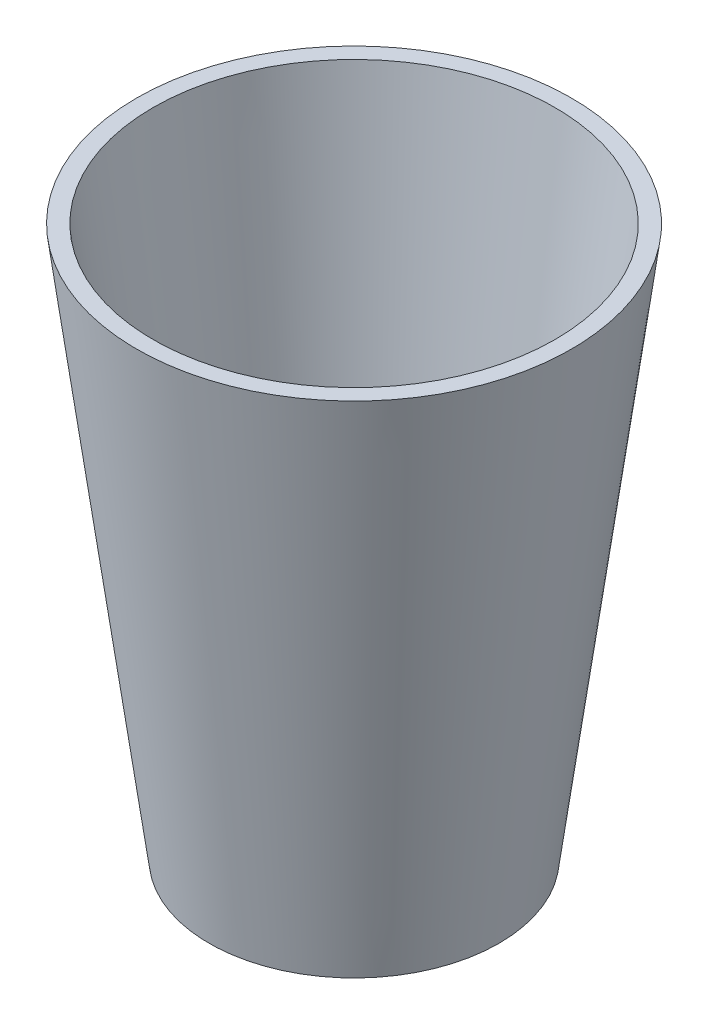
ISO-10303-21;
HEADER;
FILE_DESCRIPTION(('STEP AP214'),'2;1');
FILE_NAME('part.step','',(''),(''),'','','');
FILE_SCHEMA(('AUTOMOTIVE_DESIGN { 1 0 10303 214 1 1 1 1 }'));
ENDSEC;
DATA;
#1=APPLICATION_CONTEXT('core data for automotive mechanical design processes');
#2=APPLICATION_PROTOCOL_DEFINITION('international standard','automotive_design',2000,#1);
#3=PRODUCT_CONTEXT('',#1,'mechanical');
#4=PRODUCT('Part','Part','',(#3));
#5=PRODUCT_RELATED_PRODUCT_CATEGORY('part','',(#4));
#6=PRODUCT_DEFINITION_FORMATION('','',#4);
#7=PRODUCT_DEFINITION_CONTEXT('part definition',#1,'design');
#8=PRODUCT_DEFINITION('design','',#6,#7);
#9=PRODUCT_DEFINITION_SHAPE('','',#8);
#10=(LENGTH_UNIT() NAMED_UNIT(*) SI_UNIT(.MILLI.,.METRE.));
#11=(NAMED_UNIT(*) PLANE_ANGLE_UNIT() SI_UNIT($,.RADIAN.));
#12=(NAMED_UNIT(*) SI_UNIT($,.STERADIAN.) SOLID_ANGLE_UNIT());
#13=UNCERTAINTY_MEASURE_WITH_UNIT(LENGTH_MEASURE(1.E-05),#10,'distance_accuracy_value','');
#14=(GEOMETRIC_REPRESENTATION_CONTEXT(3) GLOBAL_UNCERTAINTY_ASSIGNED_CONTEXT((#13)) GLOBAL_UNIT_ASSIGNED_CONTEXT((#10,
#11,#12)) REPRESENTATION_CONTEXT('',''));
#15=CARTESIAN_POINT('',(0.,0.,0.));
#16=DIRECTION('',(0.,0.,1.));
#17=DIRECTION('',(1.,0.,0.));
#18=AXIS2_PLACEMENT_3D('',#15,#16,#17);
#19=CARTESIAN_POINT('',(1.13378137681529E-13,-116.94709836637,0.));
#20=DIRECTION('',(0.,1.,0.));
#21=DIRECTION('',(-1.,0.,0.));
#22=AXIS2_PLACEMENT_3D('',#19,#20,#21);
#23=PLANE('',#22);
#24=CARTESIAN_POINT('',(0.,-116.94709836637,0.));
#25=DIRECTION('',(0.,1.,0.));
#26=DIRECTION('',(-1.,0.,0.));
#27=AXIS2_PLACEMENT_3D('',#24,#25,#26);
#28=CIRCLE('',#27,28.6292763147492);
#29=CARTESIAN_POINT('',(-28.6292763147492,-116.94709836637,0.));
#30=VERTEX_POINT('',#29);
#31=EDGE_CURVE('E47',#30,#30,#28,.T.);
#32=ORIENTED_EDGE('',*,*,#31,.T.);
#33=EDGE_LOOP('',(#32));
#34=FACE_BOUND('',#33,.T.);
#35=ADVANCED_FACE('F33',(#34),#23,.T.);
#36=CARTESIAN_POINT('',(0.,-120.65,0.));
#37=DIRECTION('',(0.,1.,0.));
#38=DIRECTION('',(-1.,0.,0.));
#39=AXIS2_PLACEMENT_3D('',#36,#37,#38);
#40=PLANE('',#39);
#41=CARTESIAN_POINT('',(0.,-120.65,0.));
#42=DIRECTION('',(0.,1.,0.));
#43=DIRECTION('',(-1.,0.,0.));
#44=AXIS2_PLACEMENT_3D('',#41,#42,#43);
#45=CIRCLE('',#44,31.75);
#46=CARTESIAN_POINT('',(-31.75,-120.65,0.));
#47=VERTEX_POINT('',#46);
#48=EDGE_CURVE('E10',#47,#47,#45,.T.);
#49=ORIENTED_EDGE('',*,*,#48,.F.);
#50=EDGE_LOOP('',(#49));
#51=FACE_BOUND('',#50,.T.);
#52=ADVANCED_FACE('F67',(#51),#40,.F.);
#53=CARTESIAN_POINT('',(-1.32642552543948E-13,0.,0.));
#54=DIRECTION('',(0.,1.,0.));
#55=DIRECTION('',(-1.,0.,0.));
#56=AXIS2_PLACEMENT_3D('',#53,#54,#55);
#57=CONICAL_SURFACE('',#56,47.6250000000001,0.130827396074058);
#58=ORIENTED_EDGE('',*,*,#48,.T.);
#59=EDGE_LOOP('',(#58));
#60=FACE_BOUND('',#59,.T.);
#61=CARTESIAN_POINT('',(-1.32642552543948E-13,0.,0.));
#62=DIRECTION('',(0.,1.,0.));
#63=DIRECTION('',(-1.,0.,0.));
#64=AXIS2_PLACEMENT_3D('',#61,#62,#63);
#65=CIRCLE('',#64,47.6250000000001);
#66=CARTESIAN_POINT('',(-47.6250000000003,-1.13702433932177E-13,0.));
#67=VERTEX_POINT('',#66);
#68=EDGE_CURVE('E39',#67,#67,#65,.T.);
#69=ORIENTED_EDGE('',*,*,#68,.F.);
#70=EDGE_LOOP('',(#69));
#71=FACE_BOUND('',#70,.T.);
#72=ADVANCED_FACE('F62',(#60,#71),#57,.T.);
#73=CARTESIAN_POINT('',(0.,0.,0.));
#74=DIRECTION('',(0.,1.,0.));
#75=DIRECTION('',(-1.,0.,0.));
#76=AXIS2_PLACEMENT_3D('',#73,#74,#75);
#77=PLANE('',#76);
#78=ORIENTED_EDGE('',*,*,#68,.T.);
#79=EDGE_LOOP('',(#78));
#80=FACE_BOUND('',#79,.T.);
#81=CARTESIAN_POINT('',(-1.32642552543948E-13,0.,0.));
#82=DIRECTION('',(0.,1.,0.));
#83=DIRECTION('',(-1.,0.,0.));
#84=AXIS2_PLACEMENT_3D('',#81,#82,#83);
#85=CIRCLE('',#84,44.0170524155877);
#86=CARTESIAN_POINT('',(-44.0170524155878,-1.09294011929979E-13,0.));
#87=VERTEX_POINT('',#86);
#88=EDGE_CURVE('E43',#87,#87,#85,.T.);
#89=ORIENTED_EDGE('',*,*,#88,.F.);
#90=EDGE_LOOP('',(#89));
#91=FACE_BOUND('',#90,.T.);
#92=ADVANCED_FACE('F57',(#80,#91),#77,.T.);
#93=CARTESIAN_POINT('',(-1.32642552543948E-13,0.,0.));
#94=DIRECTION('',(0.,1.,0.));
#95=DIRECTION('',(-1.,0.,0.));
#96=AXIS2_PLACEMENT_3D('',#93,#94,#95);
#97=CONICAL_SURFACE('',#96,44.0170524155877,0.13082739607406);
#98=ORIENTED_EDGE('',*,*,#31,.F.);
#99=EDGE_LOOP('',(#98));
#100=FACE_BOUND('',#99,.T.);
#101=ORIENTED_EDGE('',*,*,#88,.T.);
#102=EDGE_LOOP('',(#101));
#103=FACE_BOUND('',#102,.T.);
#104=ADVANCED_FACE('F54',(#100,#103),#97,.F.);
#105=CLOSED_SHELL('',(#35,#52,#72,#92,#104));
#106=MANIFOLD_SOLID_BREP('B2',#105);
#107=ADVANCED_BREP_SHAPE_REPRESENTATION('',(#18,#106),#14);
#108=SHAPE_DEFINITION_REPRESENTATION(#9,#107);
ENDSEC;
END-ISO-10303-21;
